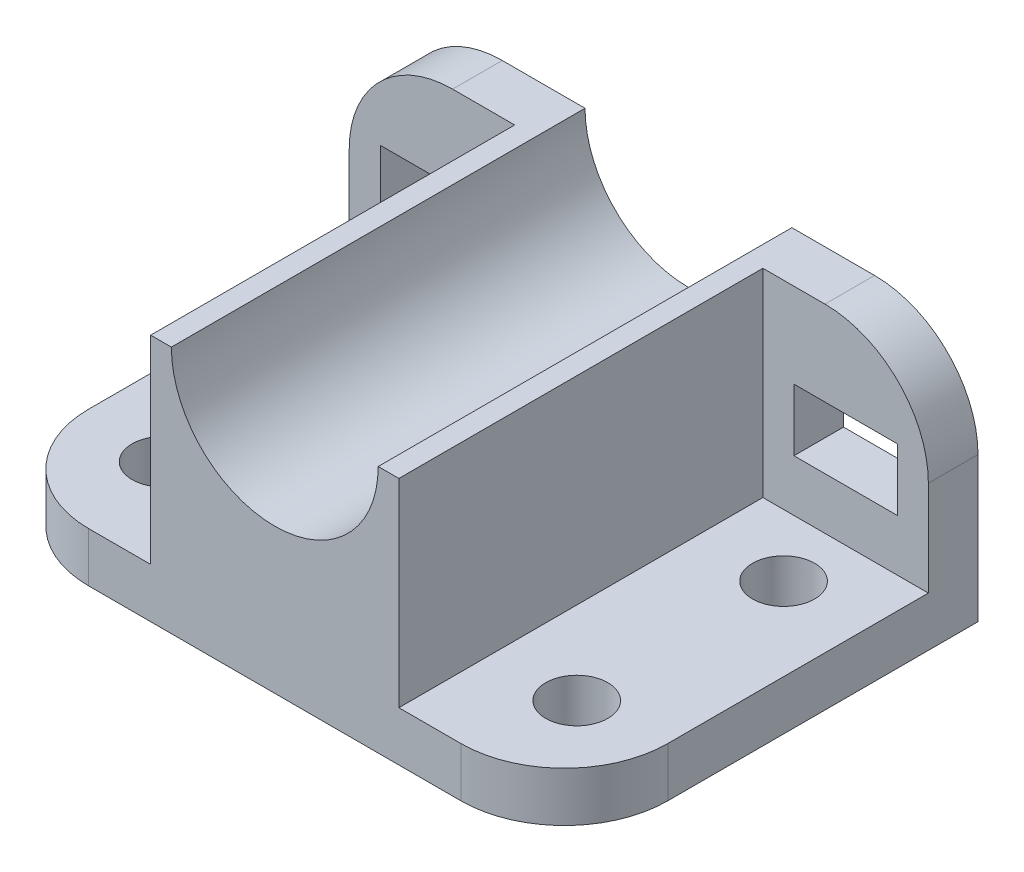
ISO-10303-21;
HEADER;
FILE_DESCRIPTION(('STEP AP214'),'2;1');
FILE_NAME('part.step','',(''),(''),'','','');
FILE_SCHEMA(('AUTOMOTIVE_DESIGN { 1 0 10303 214 1 1 1 1 }'));
ENDSEC;
DATA;
#1=APPLICATION_CONTEXT('core data for automotive mechanical design processes');
#2=APPLICATION_PROTOCOL_DEFINITION('international standard','automotive_design',2000,#1);
#3=PRODUCT_CONTEXT('',#1,'mechanical');
#4=PRODUCT('Part','Part','',(#3));
#5=PRODUCT_RELATED_PRODUCT_CATEGORY('part','',(#4));
#6=PRODUCT_DEFINITION_FORMATION('','',#4);
#7=PRODUCT_DEFINITION_CONTEXT('part definition',#1,'design');
#8=PRODUCT_DEFINITION('design','',#6,#7);
#9=PRODUCT_DEFINITION_SHAPE('','',#8);
#10=(LENGTH_UNIT() NAMED_UNIT(*) SI_UNIT(.MILLI.,.METRE.));
#11=(NAMED_UNIT(*) PLANE_ANGLE_UNIT() SI_UNIT($,.RADIAN.));
#12=(NAMED_UNIT(*) SI_UNIT($,.STERADIAN.) SOLID_ANGLE_UNIT());
#13=UNCERTAINTY_MEASURE_WITH_UNIT(LENGTH_MEASURE(1.E-05),#10,'distance_accuracy_value','');
#14=(GEOMETRIC_REPRESENTATION_CONTEXT(3) GLOBAL_UNCERTAINTY_ASSIGNED_CONTEXT((#13)) GLOBAL_UNIT_ASSIGNED_CONTEXT((#10,
#11,#12)) REPRESENTATION_CONTEXT('',''));
#15=CARTESIAN_POINT('',(0.,0.,0.));
#16=DIRECTION('',(0.,0.,1.));
#17=DIRECTION('',(1.,0.,0.));
#18=AXIS2_PLACEMENT_3D('',#15,#16,#17);
#19=CARTESIAN_POINT('',(-50.,-88.,27.));
#20=DIRECTION('',(0.,1.,0.));
#21=DIRECTION('',(0.,0.,1.));
#22=AXIS2_PLACEMENT_3D('',#19,#20,#21);
#23=CYLINDRICAL_SURFACE('',#22,7.5);
#24=CARTESIAN_POINT('',(-50.,0.,27.));
#25=DIRECTION('',(0.,-1.,0.));
#26=DIRECTION('',(0.,0.,-1.));
#27=AXIS2_PLACEMENT_3D('',#24,#25,#26);
#28=CIRCLE('',#27,7.5);
#29=CARTESIAN_POINT('',(-50.,0.,19.5));
#30=VERTEX_POINT('',#29);
#31=EDGE_CURVE('E391',#30,#30,#28,.T.);
#32=ORIENTED_EDGE('',*,*,#31,.T.);
#33=EDGE_LOOP('',(#32));
#34=FACE_BOUND('',#33,.T.);
#35=CARTESIAN_POINT('',(-50.,12.,27.));
#36=DIRECTION('',(0.,1.,0.));
#37=DIRECTION('',(0.,0.,1.));
#38=AXIS2_PLACEMENT_3D('',#35,#36,#37);
#39=CIRCLE('',#38,7.5);
#40=CARTESIAN_POINT('',(-50.,12.,34.5));
#41=VERTEX_POINT('',#40);
#42=EDGE_CURVE('E394',#41,#41,#39,.T.);
#43=ORIENTED_EDGE('',*,*,#42,.T.);
#44=EDGE_LOOP('',(#43));
#45=FACE_BOUND('',#44,.T.);
#46=ADVANCED_FACE('F32',(#34,#45),#23,.F.);
#47=CARTESIAN_POINT('',(-50.,-88.,-23.));
#48=DIRECTION('',(0.,1.,0.));
#49=DIRECTION('',(0.,0.,1.));
#50=AXIS2_PLACEMENT_3D('',#47,#48,#49);
#51=CYLINDRICAL_SURFACE('',#50,7.5);
#52=CARTESIAN_POINT('',(-50.,0.,-23.));
#53=DIRECTION('',(0.,-1.,0.));
#54=DIRECTION('',(0.,0.,-1.));
#55=AXIS2_PLACEMENT_3D('',#52,#53,#54);
#56=CIRCLE('',#55,7.5);
#57=CARTESIAN_POINT('',(-50.,0.,-30.5));
#58=VERTEX_POINT('',#57);
#59=EDGE_CURVE('E385',#58,#58,#56,.T.);
#60=ORIENTED_EDGE('',*,*,#59,.T.);
#61=EDGE_LOOP('',(#60));
#62=FACE_BOUND('',#61,.T.);
#63=CARTESIAN_POINT('',(-50.,12.,-23.));
#64=DIRECTION('',(0.,1.,0.));
#65=DIRECTION('',(0.,0.,1.));
#66=AXIS2_PLACEMENT_3D('',#63,#64,#65);
#67=CIRCLE('',#66,7.5);
#68=CARTESIAN_POINT('',(-50.,12.,-15.5));
#69=VERTEX_POINT('',#68);
#70=EDGE_CURVE('E388',#69,#69,#67,.T.);
#71=ORIENTED_EDGE('',*,*,#70,.T.);
#72=EDGE_LOOP('',(#71));
#73=FACE_BOUND('',#72,.T.);
#74=ADVANCED_FACE('F421',(#62,#73),#51,.F.);
#75=CARTESIAN_POINT('',(50.,-88.,27.));
#76=DIRECTION('',(0.,1.,0.));
#77=DIRECTION('',(0.,0.,1.));
#78=AXIS2_PLACEMENT_3D('',#75,#76,#77);
#79=CYLINDRICAL_SURFACE('',#78,7.5);
#80=CARTESIAN_POINT('',(50.,0.,27.));
#81=DIRECTION('',(0.,-1.,0.));
#82=DIRECTION('',(0.,0.,-1.));
#83=AXIS2_PLACEMENT_3D('',#80,#81,#82);
#84=CIRCLE('',#83,7.5);
#85=CARTESIAN_POINT('',(50.,0.,19.5));
#86=VERTEX_POINT('',#85);
#87=EDGE_CURVE('E377',#86,#86,#84,.T.);
#88=ORIENTED_EDGE('',*,*,#87,.T.);
#89=EDGE_LOOP('',(#88));
#90=FACE_BOUND('',#89,.T.);
#91=CARTESIAN_POINT('',(50.,12.,27.));
#92=DIRECTION('',(0.,1.,0.));
#93=DIRECTION('',(0.,0.,1.));
#94=AXIS2_PLACEMENT_3D('',#91,#92,#93);
#95=CIRCLE('',#94,7.5);
#96=CARTESIAN_POINT('',(50.,12.,34.5));
#97=VERTEX_POINT('',#96);
#98=EDGE_CURVE('E382',#97,#97,#95,.T.);
#99=ORIENTED_EDGE('',*,*,#98,.T.);
#100=EDGE_LOOP('',(#99));
#101=FACE_BOUND('',#100,.T.);
#102=ADVANCED_FACE('F426',(#90,#101),#79,.F.);
#103=CARTESIAN_POINT('',(44.9999999999998,60.,-38.));
#104=DIRECTION('',(0.,1.,0.));
#105=DIRECTION('',(0.,0.,1.));
#106=AXIS2_PLACEMENT_3D('',#103,#104,#105);
#107=PLANE('',#106);
#108=DIRECTION('',(0.,0.,-1.));
#109=VECTOR('',#108,1.);
#110=CARTESIAN_POINT('',(-25.,60.,50.));
#111=LINE('',#110,#109);
#112=CARTESIAN_POINT('',(-25.,60.,50.));
#113=VERTEX_POINT('',#112);
#114=CARTESIAN_POINT('',(-25.,60.,-50.));
#115=VERTEX_POINT('',#114);
#116=EDGE_CURVE('E274',#113,#115,#111,.T.);
#117=ORIENTED_EDGE('',*,*,#116,.T.);
#118=DIRECTION('',(1.,0.,0.));
#119=VECTOR('',#118,1.);
#120=CARTESIAN_POINT('',(44.9999999999998,60.,-50.));
#121=LINE('',#120,#119);
#122=CARTESIAN_POINT('',(-44.9999999999998,60.,-50.));
#123=VERTEX_POINT('',#122);
#124=EDGE_CURVE('E311',#123,#115,#121,.T.);
#125=ORIENTED_EDGE('',*,*,#124,.F.);
#126=DIRECTION('',(0.,0.,-1.));
#127=VECTOR('',#126,1.);
#128=CARTESIAN_POINT('',(-44.9999999999998,60.,-38.));
#129=LINE('',#128,#127);
#130=CARTESIAN_POINT('',(-44.9999999999998,60.,-38.));
#131=VERTEX_POINT('',#130);
#132=EDGE_CURVE('E324',#131,#123,#129,.T.);
#133=ORIENTED_EDGE('',*,*,#132,.F.);
#134=DIRECTION('',(1.,0.,0.));
#135=VECTOR('',#134,1.);
#136=CARTESIAN_POINT('',(44.9999999999998,60.,-38.));
#137=LINE('',#136,#135);
#138=CARTESIAN_POINT('',(-30.,60.,-38.));
#139=VERTEX_POINT('',#138);
#140=EDGE_CURVE('E298',#131,#139,#137,.T.);
#141=ORIENTED_EDGE('',*,*,#140,.T.);
#142=DIRECTION('',(0.,0.,-1.));
#143=VECTOR('',#142,1.);
#144=CARTESIAN_POINT('',(-30.,60.,50.));
#145=LINE('',#144,#143);
#146=CARTESIAN_POINT('',(-30.,60.,50.));
#147=VERTEX_POINT('',#146);
#148=EDGE_CURVE('E277',#147,#139,#145,.T.);
#149=ORIENTED_EDGE('',*,*,#148,.F.);
#150=DIRECTION('',(1.,0.,0.));
#151=VECTOR('',#150,1.);
#152=CARTESIAN_POINT('',(-30.,60.,50.));
#153=LINE('',#152,#151);
#154=EDGE_CURVE('E270',#147,#113,#153,.T.);
#155=ORIENTED_EDGE('',*,*,#154,.T.);
#156=EDGE_LOOP('',(#117,#125,#133,#141,#149,#155));
#157=FACE_BOUND('',#156,.T.);
#158=ADVANCED_FACE('F435',(#157),#107,.T.);
#159=CARTESIAN_POINT('',(-45.,12.,25.));
#160=DIRECTION('',(0.,-1.,0.));
#161=DIRECTION('',(0.,0.,-1.));
#162=AXIS2_PLACEMENT_3D('',#159,#160,#161);
#163=PLANE('',#162);
#164=ORIENTED_EDGE('',*,*,#42,.F.);
#165=EDGE_LOOP('',(#164));
#166=FACE_BOUND('',#165,.T.);
#167=ORIENTED_EDGE('',*,*,#70,.F.);
#168=EDGE_LOOP('',(#167));
#169=FACE_BOUND('',#168,.T.);
#170=DIRECTION('',(1.,0.,0.));
#171=VECTOR('',#170,1.);
#172=CARTESIAN_POINT('',(-44.9999999999998,12.,50.));
#173=LINE('',#172,#171);
#174=CARTESIAN_POINT('',(-44.9999999999998,12.,50.));
#175=VERTEX_POINT('',#174);
#176=CARTESIAN_POINT('',(-30.,12.,50.));
#177=VERTEX_POINT('',#176);
#178=EDGE_CURVE('E334',#175,#177,#173,.T.);
#179=ORIENTED_EDGE('',*,*,#178,.T.);
#180=DIRECTION('',(0.,0.,-1.));
#181=VECTOR('',#180,1.);
#182=CARTESIAN_POINT('',(-30.,12.,50.));
#183=LINE('',#182,#181);
#184=CARTESIAN_POINT('',(-30.,12.,-38.));
#185=VERTEX_POINT('',#184);
#186=EDGE_CURVE('E279',#177,#185,#183,.T.);
#187=ORIENTED_EDGE('',*,*,#186,.T.);
#188=DIRECTION('',(-1.,0.,0.));
#189=VECTOR('',#188,1.);
#190=CARTESIAN_POINT('',(70.,12.,-38.));
#191=LINE('',#190,#189);
#192=CARTESIAN_POINT('',(-70.,12.,-38.));
#193=VERTEX_POINT('',#192);
#194=EDGE_CURVE('E291',#185,#193,#191,.T.);
#195=ORIENTED_EDGE('',*,*,#194,.T.);
#196=DIRECTION('',(0.,0.,1.));
#197=VECTOR('',#196,1.);
#198=CARTESIAN_POINT('',(-70.,12.,-50.));
#199=LINE('',#198,#197);
#200=CARTESIAN_POINT('',(-70.,12.,24.9999999999998));
#201=VERTEX_POINT('',#200);
#202=EDGE_CURVE('E328',#193,#201,#199,.T.);
#203=ORIENTED_EDGE('',*,*,#202,.T.);
#204=CARTESIAN_POINT('',(-45.,12.,25.));
#205=DIRECTION('',(0.,1.,0.));
#206=DIRECTION('',(0.,0.,-1.));
#207=AXIS2_PLACEMENT_3D('',#204,#205,#206);
#208=CIRCLE('',#207,25.);
#209=EDGE_CURVE('E330',#201,#175,#208,.T.);
#210=ORIENTED_EDGE('',*,*,#209,.T.);
#211=EDGE_LOOP('',(#179,#187,#195,#203,#210));
#212=FACE_BOUND('',#211,.T.);
#213=ADVANCED_FACE('F432',(#166,#169,#212),#163,.F.);
#214=CARTESIAN_POINT('',(-45.,35.,-38.));
#215=DIRECTION('',(0.,0.,-1.));
#216=DIRECTION('',(-1.,0.,0.));
#217=AXIS2_PLACEMENT_3D('',#214,#215,#216);
#218=PLANE('',#217);
#219=DIRECTION('',(0.,-1.,0.));
#220=VECTOR('',#219,1.);
#221=CARTESIAN_POINT('',(-62.5,39.5,-38.));
#222=LINE('',#221,#220);
#223=CARTESIAN_POINT('',(-62.5,39.5,-38.));
#224=VERTEX_POINT('',#223);
#225=CARTESIAN_POINT('',(-62.5,24.5,-38.));
#226=VERTEX_POINT('',#225);
#227=EDGE_CURVE('E204',#224,#226,#222,.T.);
#228=ORIENTED_EDGE('',*,*,#227,.F.);
#229=DIRECTION('',(-1.,0.,0.));
#230=VECTOR('',#229,1.);
#231=CARTESIAN_POINT('',(-37.5,39.5,-38.));
#232=LINE('',#231,#230);
#233=CARTESIAN_POINT('',(-37.5,39.5,-38.));
#234=VERTEX_POINT('',#233);
#235=EDGE_CURVE('E46',#234,#224,#232,.T.);
#236=ORIENTED_EDGE('',*,*,#235,.F.);
#237=DIRECTION('',(0.,1.,0.));
#238=VECTOR('',#237,1.);
#239=CARTESIAN_POINT('',(-37.5,39.5,-38.));
#240=LINE('',#239,#238);
#241=CARTESIAN_POINT('',(-37.5,24.5,-38.));
#242=VERTEX_POINT('',#241);
#243=EDGE_CURVE('E211',#242,#234,#240,.T.);
#244=ORIENTED_EDGE('',*,*,#243,.F.);
#245=DIRECTION('',(1.,0.,0.));
#246=VECTOR('',#245,1.);
#247=CARTESIAN_POINT('',(-37.5,24.5,-38.));
#248=LINE('',#247,#246);
#249=EDGE_CURVE('E195',#226,#242,#248,.T.);
#250=ORIENTED_EDGE('',*,*,#249,.F.);
#251=EDGE_LOOP('',(#228,#236,#244,#250));
#252=FACE_BOUND('',#251,.T.);
#253=ORIENTED_EDGE('',*,*,#194,.F.);
#254=DIRECTION('',(0.,1.,0.));
#255=VECTOR('',#254,1.);
#256=CARTESIAN_POINT('',(-30.,35.,-38.));
#257=LINE('',#256,#255);
#258=EDGE_CURVE('E374',#185,#139,#257,.T.);
#259=ORIENTED_EDGE('',*,*,#258,.T.);
#260=ORIENTED_EDGE('',*,*,#140,.F.);
#261=CARTESIAN_POINT('',(-45.,35.,-38.));
#262=DIRECTION('',(0.,0.,-1.));
#263=DIRECTION('',(-1.,0.,0.));
#264=AXIS2_PLACEMENT_3D('',#261,#262,#263);
#265=CIRCLE('',#264,25.);
#266=CARTESIAN_POINT('',(-70.,34.9999999999998,-38.));
#267=VERTEX_POINT('',#266);
#268=EDGE_CURVE('E294',#267,#131,#265,.T.);
#269=ORIENTED_EDGE('',*,*,#268,.F.);
#270=DIRECTION('',(0.,1.,0.));
#271=VECTOR('',#270,1.);
#272=CARTESIAN_POINT('',(-70.,34.9999999999998,-38.));
#273=LINE('',#272,#271);
#274=EDGE_CURVE('E290',#193,#267,#273,.T.);
#275=ORIENTED_EDGE('',*,*,#274,.F.);
#276=EDGE_LOOP('',(#253,#259,#260,#269,#275));
#277=FACE_BOUND('',#276,.T.);
#278=ADVANCED_FACE('F208',(#252,#277),#218,.F.);
#279=CARTESIAN_POINT('',(-70.,12.,-50.));
#280=DIRECTION('',(1.,0.,0.));
#281=DIRECTION('',(0.,0.,-1.));
#282=AXIS2_PLACEMENT_3D('',#279,#280,#281);
#283=PLANE('',#282);
#284=DIRECTION('',(0.,0.,1.));
#285=VECTOR('',#284,1.);
#286=CARTESIAN_POINT('',(-70.,0.,-50.));
#287=LINE('',#286,#285);
#288=CARTESIAN_POINT('',(-70.,0.,-50.));
#289=VERTEX_POINT('',#288);
#290=CARTESIAN_POINT('',(-70.,0.,24.9999999999998));
#291=VERTEX_POINT('',#290);
#292=EDGE_CURVE('E320',#289,#291,#287,.T.);
#293=ORIENTED_EDGE('',*,*,#292,.T.);
#294=DIRECTION('',(0.,-1.,0.));
#295=VECTOR('',#294,1.);
#296=CARTESIAN_POINT('',(-70.,12.,24.9999999999998));
#297=LINE('',#296,#295);
#298=EDGE_CURVE('E368',#201,#291,#297,.T.);
#299=ORIENTED_EDGE('',*,*,#298,.F.);
#300=ORIENTED_EDGE('',*,*,#202,.F.);
#301=ORIENTED_EDGE('',*,*,#274,.T.);
#302=DIRECTION('',(0.,0.,-1.));
#303=VECTOR('',#302,1.);
#304=CARTESIAN_POINT('',(-70.,34.9999999999998,-38.));
#305=LINE('',#304,#303);
#306=CARTESIAN_POINT('',(-70.,34.9999999999998,-50.));
#307=VERTEX_POINT('',#306);
#308=EDGE_CURVE('E307',#267,#307,#305,.T.);
#309=ORIENTED_EDGE('',*,*,#308,.T.);
#310=DIRECTION('',(0.,-1.,0.));
#311=VECTOR('',#310,1.);
#312=CARTESIAN_POINT('',(-70.,12.,-50.));
#313=LINE('',#312,#311);
#314=EDGE_CURVE('E342',#307,#289,#313,.T.);
#315=ORIENTED_EDGE('',*,*,#314,.T.);
#316=EDGE_LOOP('',(#293,#299,#300,#301,#309,#315));
#317=FACE_BOUND('',#316,.T.);
#318=ADVANCED_FACE('F462',(#317),#283,.F.);
#319=CARTESIAN_POINT('',(-45.,12.,25.));
#320=DIRECTION('',(0.,-1.,0.));
#321=DIRECTION('',(0.,0.,-1.));
#322=AXIS2_PLACEMENT_3D('',#319,#320,#321);
#323=CYLINDRICAL_SURFACE('',#322,25.);
#324=CARTESIAN_POINT('',(-45.,0.,25.));
#325=DIRECTION('',(0.,1.,0.));
#326=DIRECTION('',(0.,0.,-1.));
#327=AXIS2_PLACEMENT_3D('',#324,#325,#326);
#328=CIRCLE('',#327,25.);
#329=CARTESIAN_POINT('',(-44.9999999999998,0.,50.));
#330=VERTEX_POINT('',#329);
#331=EDGE_CURVE('E345',#291,#330,#328,.T.);
#332=ORIENTED_EDGE('',*,*,#331,.T.);
#333=DIRECTION('',(0.,-1.,0.));
#334=VECTOR('',#333,1.);
#335=CARTESIAN_POINT('',(-44.9999999999998,12.,50.));
#336=LINE('',#335,#334);
#337=EDGE_CURVE('E365',#175,#330,#336,.T.);
#338=ORIENTED_EDGE('',*,*,#337,.F.);
#339=ORIENTED_EDGE('',*,*,#209,.F.);
#340=ORIENTED_EDGE('',*,*,#298,.T.);
#341=EDGE_LOOP('',(#332,#338,#339,#340));
#342=FACE_BOUND('',#341,.T.);
#343=ADVANCED_FACE('F465',(#342),#323,.T.);
#344=CARTESIAN_POINT('',(-44.9999999999998,12.,50.));
#345=DIRECTION('',(0.,0.,-1.));
#346=DIRECTION('',(-1.,0.,0.));
#347=AXIS2_PLACEMENT_3D('',#344,#345,#346);
#348=PLANE('',#347);
#349=DIRECTION('',(1.,0.,0.));
#350=VECTOR('',#349,1.);
#351=CARTESIAN_POINT('',(-44.9999999999998,0.,50.));
#352=LINE('',#351,#350);
#353=CARTESIAN_POINT('',(44.9999999999998,0.,50.));
#354=VERTEX_POINT('',#353);
#355=EDGE_CURVE('E347',#330,#354,#352,.T.);
#356=ORIENTED_EDGE('',*,*,#355,.T.);
#357=DIRECTION('',(0.,-1.,0.));
#358=VECTOR('',#357,1.);
#359=CARTESIAN_POINT('',(44.9999999999998,12.,50.));
#360=LINE('',#359,#358);
#361=CARTESIAN_POINT('',(44.9999999999998,12.,50.));
#362=VERTEX_POINT('',#361);
#363=EDGE_CURVE('E362',#362,#354,#360,.T.);
#364=ORIENTED_EDGE('',*,*,#363,.F.);
#365=CARTESIAN_POINT('',(30.,12.,50.));
#366=VERTEX_POINT('',#365);
#367=EDGE_CURVE('E333',#366,#362,#173,.T.);
#368=ORIENTED_EDGE('',*,*,#367,.F.);
#369=DIRECTION('',(0.,-1.,0.));
#370=VECTOR('',#369,1.);
#371=CARTESIAN_POINT('',(30.,60.,50.));
#372=LINE('',#371,#370);
#373=CARTESIAN_POINT('',(30.,60.,50.));
#374=VERTEX_POINT('',#373);
#375=EDGE_CURVE('E265',#374,#366,#372,.T.);
#376=ORIENTED_EDGE('',*,*,#375,.F.);
#377=DIRECTION('',(1.,0.,0.));
#378=VECTOR('',#377,1.);
#379=CARTESIAN_POINT('',(25.,60.,50.));
#380=LINE('',#379,#378);
#381=CARTESIAN_POINT('',(25.,60.,50.));
#382=VERTEX_POINT('',#381);
#383=EDGE_CURVE('E262',#382,#374,#380,.T.);
#384=ORIENTED_EDGE('',*,*,#383,.F.);
#385=CARTESIAN_POINT('',(0.,60.,50.));
#386=DIRECTION('',(0.,0.,1.));
#387=DIRECTION('',(-1.,0.,0.));
#388=AXIS2_PLACEMENT_3D('',#385,#386,#387);
#389=CIRCLE('',#388,25.);
#390=EDGE_CURVE('E259',#113,#382,#389,.T.);
#391=ORIENTED_EDGE('',*,*,#390,.F.);
#392=ORIENTED_EDGE('',*,*,#154,.F.);
#393=DIRECTION('',(0.,1.,0.));
#394=VECTOR('',#393,1.);
#395=CARTESIAN_POINT('',(-30.,12.,50.));
#396=LINE('',#395,#394);
#397=EDGE_CURVE('E267',#177,#147,#396,.T.);
#398=ORIENTED_EDGE('',*,*,#397,.F.);
#399=ORIENTED_EDGE('',*,*,#178,.F.);
#400=ORIENTED_EDGE('',*,*,#337,.T.);
#401=EDGE_LOOP('',(#356,#364,#368,#376,#384,#391,#392,#398,#399,#400));
#402=FACE_BOUND('',#401,.T.);
#403=ADVANCED_FACE('F446',(#402),#348,.F.);
#404=CARTESIAN_POINT('',(45.,12.,25.));
#405=DIRECTION('',(0.,-1.,0.));
#406=DIRECTION('',(0.,0.,-1.));
#407=AXIS2_PLACEMENT_3D('',#404,#405,#406);
#408=CYLINDRICAL_SURFACE('',#407,25.);
#409=CARTESIAN_POINT('',(45.,0.,25.));
#410=DIRECTION('',(0.,1.,0.));
#411=DIRECTION('',(0.,0.,1.));
#412=AXIS2_PLACEMENT_3D('',#409,#410,#411);
#413=CIRCLE('',#412,25.);
#414=CARTESIAN_POINT('',(70.,0.,24.9999999999998));
#415=VERTEX_POINT('',#414);
#416=EDGE_CURVE('E349',#354,#415,#413,.T.);
#417=ORIENTED_EDGE('',*,*,#416,.T.);
#418=DIRECTION('',(0.,-1.,0.));
#419=VECTOR('',#418,1.);
#420=CARTESIAN_POINT('',(70.,12.,24.9999999999998));
#421=LINE('',#420,#419);
#422=CARTESIAN_POINT('',(70.,12.,24.9999999999998));
#423=VERTEX_POINT('',#422);
#424=EDGE_CURVE('E359',#423,#415,#421,.T.);
#425=ORIENTED_EDGE('',*,*,#424,.F.);
#426=CARTESIAN_POINT('',(45.,12.,25.));
#427=DIRECTION('',(0.,1.,0.));
#428=DIRECTION('',(0.,0.,1.));
#429=AXIS2_PLACEMENT_3D('',#426,#427,#428);
#430=CIRCLE('',#429,25.);
#431=EDGE_CURVE('E337',#362,#423,#430,.T.);
#432=ORIENTED_EDGE('',*,*,#431,.F.);
#433=ORIENTED_EDGE('',*,*,#363,.T.);
#434=EDGE_LOOP('',(#417,#425,#432,#433));
#435=FACE_BOUND('',#434,.T.);
#436=ADVANCED_FACE('F476',(#435),#408,.T.);
#437=CARTESIAN_POINT('',(70.,12.,-50.));
#438=DIRECTION('',(-1.,0.,0.));
#439=DIRECTION('',(0.,0.,1.));
#440=AXIS2_PLACEMENT_3D('',#437,#438,#439);
#441=PLANE('',#440);
#442=DIRECTION('',(0.,0.,-1.));
#443=VECTOR('',#442,1.);
#444=CARTESIAN_POINT('',(70.,0.,-50.));
#445=LINE('',#444,#443);
#446=CARTESIAN_POINT('',(70.,0.,-50.));
#447=VERTEX_POINT('',#446);
#448=EDGE_CURVE('E351',#415,#447,#445,.T.);
#449=ORIENTED_EDGE('',*,*,#448,.T.);
#450=DIRECTION('',(0.,-1.,0.));
#451=VECTOR('',#450,1.);
#452=CARTESIAN_POINT('',(70.,12.,-50.));
#453=LINE('',#452,#451);
#454=CARTESIAN_POINT('',(70.,34.9999999999998,-50.));
#455=VERTEX_POINT('',#454);
#456=EDGE_CURVE('E356',#455,#447,#453,.T.);
#457=ORIENTED_EDGE('',*,*,#456,.F.);
#458=DIRECTION('',(0.,0.,-1.));
#459=VECTOR('',#458,1.);
#460=CARTESIAN_POINT('',(70.,34.9999999999998,-38.));
#461=LINE('',#460,#459);
#462=CARTESIAN_POINT('',(70.,34.9999999999998,-38.));
#463=VERTEX_POINT('',#462);
#464=EDGE_CURVE('E317',#463,#455,#461,.T.);
#465=ORIENTED_EDGE('',*,*,#464,.F.);
#466=DIRECTION('',(0.,-1.,0.));
#467=VECTOR('',#466,1.);
#468=CARTESIAN_POINT('',(70.,12.,-38.));
#469=LINE('',#468,#467);
#470=CARTESIAN_POINT('',(70.,12.,-38.));
#471=VERTEX_POINT('',#470);
#472=EDGE_CURVE('E304',#463,#471,#469,.T.);
#473=ORIENTED_EDGE('',*,*,#472,.T.);
#474=DIRECTION('',(0.,0.,-1.));
#475=VECTOR('',#474,1.);
#476=CARTESIAN_POINT('',(70.,12.,-50.));
#477=LINE('',#476,#475);
#478=EDGE_CURVE('E339',#423,#471,#477,.T.);
#479=ORIENTED_EDGE('',*,*,#478,.F.);
#480=ORIENTED_EDGE('',*,*,#424,.T.);
#481=EDGE_LOOP('',(#449,#457,#465,#473,#479,#480));
#482=FACE_BOUND('',#481,.T.);
#483=ADVANCED_FACE('F493',(#482),#441,.F.);
#484=CARTESIAN_POINT('',(-70.,12.,-50.));
#485=DIRECTION('',(0.,0.,1.));
#486=DIRECTION('',(1.,0.,0.));
#487=AXIS2_PLACEMENT_3D('',#484,#485,#486);
#488=PLANE('',#487);
#489=DIRECTION('',(0.,1.,0.));
#490=VECTOR('',#489,1.);
#491=CARTESIAN_POINT('',(-37.5,12.,-50.));
#492=LINE('',#491,#490);
#493=CARTESIAN_POINT('',(-37.5,24.5,-50.));
#494=VERTEX_POINT('',#493);
#495=CARTESIAN_POINT('',(-37.5,39.5,-50.));
#496=VERTEX_POINT('',#495);
#497=EDGE_CURVE('E39',#494,#496,#492,.T.);
#498=ORIENTED_EDGE('',*,*,#497,.T.);
#499=DIRECTION('',(-1.,0.,0.));
#500=VECTOR('',#499,1.);
#501=CARTESIAN_POINT('',(-70.,39.5,-50.));
#502=LINE('',#501,#500);
#503=CARTESIAN_POINT('',(-62.5,39.5,-50.));
#504=VERTEX_POINT('',#503);
#505=EDGE_CURVE('E11',#496,#504,#502,.T.);
#506=ORIENTED_EDGE('',*,*,#505,.T.);
#507=DIRECTION('',(0.,-1.,0.));
#508=VECTOR('',#507,1.);
#509=CARTESIAN_POINT('',(-62.5,12.,-50.));
#510=LINE('',#509,#508);
#511=CARTESIAN_POINT('',(-62.5,24.5,-50.));
#512=VERTEX_POINT('',#511);
#513=EDGE_CURVE('E397',#504,#512,#510,.T.);
#514=ORIENTED_EDGE('',*,*,#513,.T.);
#515=DIRECTION('',(1.,0.,0.));
#516=VECTOR('',#515,1.);
#517=CARTESIAN_POINT('',(-70.,24.5,-50.));
#518=LINE('',#517,#516);
#519=EDGE_CURVE('E198',#512,#494,#518,.T.);
#520=ORIENTED_EDGE('',*,*,#519,.T.);
#521=EDGE_LOOP('',(#498,#506,#514,#520));
#522=FACE_BOUND('',#521,.T.);
#523=DIRECTION('',(-1.,0.,0.));
#524=VECTOR('',#523,1.);
#525=CARTESIAN_POINT('',(-70.,39.5,-50.));
#526=LINE('',#525,#524);
#527=CARTESIAN_POINT('',(62.5,39.5,-50.));
#528=VERTEX_POINT('',#527);
#529=CARTESIAN_POINT('',(37.5,39.5,-50.));
#530=VERTEX_POINT('',#529);
#531=EDGE_CURVE('E246',#528,#530,#526,.T.);
#532=ORIENTED_EDGE('',*,*,#531,.T.);
#533=DIRECTION('',(0.,-1.,0.));
#534=VECTOR('',#533,1.);
#535=CARTESIAN_POINT('',(37.5,12.,-50.));
#536=LINE('',#535,#534);
#537=CARTESIAN_POINT('',(37.5,24.5,-50.));
#538=VERTEX_POINT('',#537);
#539=EDGE_CURVE('E249',#530,#538,#536,.T.);
#540=ORIENTED_EDGE('',*,*,#539,.T.);
#541=DIRECTION('',(1.,0.,0.));
#542=VECTOR('',#541,1.);
#543=CARTESIAN_POINT('',(-70.,24.5,-50.));
#544=LINE('',#543,#542);
#545=CARTESIAN_POINT('',(62.5,24.5,-50.));
#546=VERTEX_POINT('',#545);
#547=EDGE_CURVE('E234',#538,#546,#544,.T.);
#548=ORIENTED_EDGE('',*,*,#547,.T.);
#549=DIRECTION('',(0.,1.,0.));
#550=VECTOR('',#549,1.);
#551=CARTESIAN_POINT('',(62.5,12.,-50.));
#552=LINE('',#551,#550);
#553=EDGE_CURVE('E243',#546,#528,#552,.T.);
#554=ORIENTED_EDGE('',*,*,#553,.T.);
#555=EDGE_LOOP('',(#532,#540,#548,#554));
#556=FACE_BOUND('',#555,.T.);
#557=ORIENTED_EDGE('',*,*,#124,.T.);
#558=CARTESIAN_POINT('',(0.,60.,-50.));
#559=DIRECTION('',(0.,0.,1.));
#560=DIRECTION('',(1.,0.,0.));
#561=AXIS2_PLACEMENT_3D('',#558,#559,#560);
#562=CIRCLE('',#561,25.);
#563=CARTESIAN_POINT('',(25.,60.,-50.));
#564=VERTEX_POINT('',#563);
#565=EDGE_CURVE('E256',#115,#564,#562,.T.);
#566=ORIENTED_EDGE('',*,*,#565,.T.);
#567=CARTESIAN_POINT('',(44.9999999999998,60.,-50.));
#568=VERTEX_POINT('',#567);
#569=EDGE_CURVE('E310',#564,#568,#121,.T.);
#570=ORIENTED_EDGE('',*,*,#569,.T.);
#571=CARTESIAN_POINT('',(45.,35.,-50.));
#572=DIRECTION('',(0.,0.,-1.));
#573=DIRECTION('',(1.,0.,0.));
#574=AXIS2_PLACEMENT_3D('',#571,#572,#573);
#575=CIRCLE('',#574,25.);
#576=EDGE_CURVE('E314',#568,#455,#575,.T.);
#577=ORIENTED_EDGE('',*,*,#576,.T.);
#578=ORIENTED_EDGE('',*,*,#456,.T.);
#579=DIRECTION('',(-1.,0.,0.));
#580=VECTOR('',#579,1.);
#581=CARTESIAN_POINT('',(-70.,0.,-50.));
#582=LINE('',#581,#580);
#583=EDGE_CURVE('E331',#447,#289,#582,.T.);
#584=ORIENTED_EDGE('',*,*,#583,.T.);
#585=ORIENTED_EDGE('',*,*,#314,.F.);
#586=CARTESIAN_POINT('',(-45.,35.,-50.));
#587=DIRECTION('',(0.,0.,-1.));
#588=DIRECTION('',(-1.,0.,0.));
#589=AXIS2_PLACEMENT_3D('',#586,#587,#588);
#590=CIRCLE('',#589,25.);
#591=EDGE_CURVE('E276',#307,#123,#590,.T.);
#592=ORIENTED_EDGE('',*,*,#591,.T.);
#593=EDGE_LOOP('',(#557,#566,#570,#577,#578,#584,#585,#592));
#594=FACE_BOUND('',#593,.T.);
#595=ADVANCED_FACE('F401',(#522,#556,#594),#488,.F.);
#596=ORIENTED_EDGE('',*,*,#98,.F.);
#597=EDGE_LOOP('',(#596));
#598=FACE_BOUND('',#597,.T.);
#599=CARTESIAN_POINT('',(50.,12.,-23.));
#600=DIRECTION('',(0.,1.,0.));
#601=DIRECTION('',(0.,0.,1.));
#602=AXIS2_PLACEMENT_3D('',#599,#600,#601);
#603=CIRCLE('',#602,7.5);
#604=CARTESIAN_POINT('',(50.,12.,-15.5));
#605=VERTEX_POINT('',#604);
#606=EDGE_CURVE('E252',#605,#605,#603,.T.);
#607=ORIENTED_EDGE('',*,*,#606,.F.);
#608=EDGE_LOOP('',(#607));
#609=FACE_BOUND('',#608,.T.);
#610=CARTESIAN_POINT('',(30.,12.,-38.));
#611=VERTEX_POINT('',#610);
#612=EDGE_CURVE('E287',#471,#611,#191,.T.);
#613=ORIENTED_EDGE('',*,*,#612,.T.);
#614=DIRECTION('',(0.,0.,-1.));
#615=VECTOR('',#614,1.);
#616=CARTESIAN_POINT('',(30.,12.,50.));
#617=LINE('',#616,#615);
#618=EDGE_CURVE('E282',#366,#611,#617,.T.);
#619=ORIENTED_EDGE('',*,*,#618,.F.);
#620=ORIENTED_EDGE('',*,*,#367,.T.);
#621=ORIENTED_EDGE('',*,*,#431,.T.);
#622=ORIENTED_EDGE('',*,*,#478,.T.);
#623=EDGE_LOOP('',(#613,#619,#620,#621,#622));
#624=FACE_BOUND('',#623,.T.);
#625=ADVANCED_FACE('F437',(#598,#609,#624),#163,.F.);
#626=CARTESIAN_POINT('',(-45.,0.,25.));
#627=DIRECTION('',(0.,-1.,0.));
#628=DIRECTION('',(0.,0.,-1.));
#629=AXIS2_PLACEMENT_3D('',#626,#627,#628);
#630=PLANE('',#629);
#631=ORIENTED_EDGE('',*,*,#31,.F.);
#632=EDGE_LOOP('',(#631));
#633=FACE_BOUND('',#632,.T.);
#634=ORIENTED_EDGE('',*,*,#59,.F.);
#635=EDGE_LOOP('',(#634));
#636=FACE_BOUND('',#635,.T.);
#637=ORIENTED_EDGE('',*,*,#87,.F.);
#638=EDGE_LOOP('',(#637));
#639=FACE_BOUND('',#638,.T.);
#640=CARTESIAN_POINT('',(50.,0.,-23.));
#641=DIRECTION('',(0.,-1.,0.));
#642=DIRECTION('',(0.,0.,-1.));
#643=AXIS2_PLACEMENT_3D('',#640,#641,#642);
#644=CIRCLE('',#643,7.5);
#645=CARTESIAN_POINT('',(50.,0.,-30.5));
#646=VERTEX_POINT('',#645);
#647=EDGE_CURVE('E255',#646,#646,#644,.T.);
#648=ORIENTED_EDGE('',*,*,#647,.F.);
#649=EDGE_LOOP('',(#648));
#650=FACE_BOUND('',#649,.T.);
#651=ORIENTED_EDGE('',*,*,#292,.F.);
#652=ORIENTED_EDGE('',*,*,#583,.F.);
#653=ORIENTED_EDGE('',*,*,#448,.F.);
#654=ORIENTED_EDGE('',*,*,#416,.F.);
#655=ORIENTED_EDGE('',*,*,#355,.F.);
#656=ORIENTED_EDGE('',*,*,#331,.F.);
#657=EDGE_LOOP('',(#651,#652,#653,#654,#655,#656));
#658=FACE_BOUND('',#657,.T.);
#659=ADVANCED_FACE('F468',(#633,#636,#639,#650,#658),#630,.T.);
#660=CARTESIAN_POINT('',(45.,35.,-38.));
#661=DIRECTION('',(0.,0.,-1.));
#662=DIRECTION('',(-1.,0.,0.));
#663=AXIS2_PLACEMENT_3D('',#660,#661,#662);
#664=CYLINDRICAL_SURFACE('',#663,25.);
#665=ORIENTED_EDGE('',*,*,#576,.F.);
#666=DIRECTION('',(0.,0.,-1.));
#667=VECTOR('',#666,1.);
#668=CARTESIAN_POINT('',(44.9999999999998,60.,-38.));
#669=LINE('',#668,#667);
#670=CARTESIAN_POINT('',(44.9999999999998,60.,-38.));
#671=VERTEX_POINT('',#670);
#672=EDGE_CURVE('E321',#671,#568,#669,.T.);
#673=ORIENTED_EDGE('',*,*,#672,.F.);
#674=CARTESIAN_POINT('',(45.,35.,-38.));
#675=DIRECTION('',(0.,0.,-1.));
#676=DIRECTION('',(1.,0.,0.));
#677=AXIS2_PLACEMENT_3D('',#674,#675,#676);
#678=CIRCLE('',#677,25.);
#679=EDGE_CURVE('E301',#671,#463,#678,.T.);
#680=ORIENTED_EDGE('',*,*,#679,.T.);
#681=ORIENTED_EDGE('',*,*,#464,.T.);
#682=EDGE_LOOP('',(#665,#673,#680,#681));
#683=FACE_BOUND('',#682,.T.);
#684=ADVANCED_FACE('F517',(#683),#664,.T.);
#685=ORIENTED_EDGE('',*,*,#569,.F.);
#686=DIRECTION('',(0.,0.,-1.));
#687=VECTOR('',#686,1.);
#688=CARTESIAN_POINT('',(25.,60.,50.));
#689=LINE('',#688,#687);
#690=EDGE_CURVE('E273',#382,#564,#689,.T.);
#691=ORIENTED_EDGE('',*,*,#690,.F.);
#692=ORIENTED_EDGE('',*,*,#383,.T.);
#693=DIRECTION('',(0.,0.,-1.));
#694=VECTOR('',#693,1.);
#695=CARTESIAN_POINT('',(30.,60.,50.));
#696=LINE('',#695,#694);
#697=CARTESIAN_POINT('',(30.,60.,-38.));
#698=VERTEX_POINT('',#697);
#699=EDGE_CURVE('E284',#374,#698,#696,.T.);
#700=ORIENTED_EDGE('',*,*,#699,.T.);
#701=EDGE_CURVE('E297',#698,#671,#137,.T.);
#702=ORIENTED_EDGE('',*,*,#701,.T.);
#703=ORIENTED_EDGE('',*,*,#672,.T.);
#704=EDGE_LOOP('',(#685,#691,#692,#700,#702,#703));
#705=FACE_BOUND('',#704,.T.);
#706=ADVANCED_FACE('F486',(#705),#107,.T.);
#707=CARTESIAN_POINT('',(-45.,35.,-38.));
#708=DIRECTION('',(0.,0.,-1.));
#709=DIRECTION('',(-1.,0.,0.));
#710=AXIS2_PLACEMENT_3D('',#707,#708,#709);
#711=CYLINDRICAL_SURFACE('',#710,25.);
#712=ORIENTED_EDGE('',*,*,#591,.F.);
#713=ORIENTED_EDGE('',*,*,#308,.F.);
#714=ORIENTED_EDGE('',*,*,#268,.T.);
#715=ORIENTED_EDGE('',*,*,#132,.T.);
#716=EDGE_LOOP('',(#712,#713,#714,#715));
#717=FACE_BOUND('',#716,.T.);
#718=ADVANCED_FACE('F459',(#717),#711,.T.);
#719=DIRECTION('',(1.,0.,0.));
#720=VECTOR('',#719,1.);
#721=CARTESIAN_POINT('',(37.5,24.5,-38.));
#722=LINE('',#721,#720);
#723=CARTESIAN_POINT('',(37.5,24.5,-38.));
#724=VERTEX_POINT('',#723);
#725=CARTESIAN_POINT('',(62.5,24.5,-38.));
#726=VERTEX_POINT('',#725);
#727=EDGE_CURVE('E222',#724,#726,#722,.T.);
#728=ORIENTED_EDGE('',*,*,#727,.F.);
#729=DIRECTION('',(0.,-1.,0.));
#730=VECTOR('',#729,1.);
#731=CARTESIAN_POINT('',(37.5,39.5,-38.));
#732=LINE('',#731,#730);
#733=CARTESIAN_POINT('',(37.5,39.5,-38.));
#734=VERTEX_POINT('',#733);
#735=EDGE_CURVE('E218',#734,#724,#732,.T.);
#736=ORIENTED_EDGE('',*,*,#735,.F.);
#737=DIRECTION('',(-1.,0.,0.));
#738=VECTOR('',#737,1.);
#739=CARTESIAN_POINT('',(37.5,39.5,-38.));
#740=LINE('',#739,#738);
#741=CARTESIAN_POINT('',(62.5,39.5,-38.));
#742=VERTEX_POINT('',#741);
#743=EDGE_CURVE('E228',#742,#734,#740,.T.);
#744=ORIENTED_EDGE('',*,*,#743,.F.);
#745=DIRECTION('',(0.,1.,0.));
#746=VECTOR('',#745,1.);
#747=CARTESIAN_POINT('',(62.5,39.5,-38.));
#748=LINE('',#747,#746);
#749=EDGE_CURVE('E225',#726,#742,#748,.T.);
#750=ORIENTED_EDGE('',*,*,#749,.F.);
#751=EDGE_LOOP('',(#728,#736,#744,#750));
#752=FACE_BOUND('',#751,.T.);
#753=ORIENTED_EDGE('',*,*,#701,.F.);
#754=DIRECTION('',(0.,-1.,0.));
#755=VECTOR('',#754,1.);
#756=CARTESIAN_POINT('',(30.,35.,-38.));
#757=LINE('',#756,#755);
#758=EDGE_CURVE('E371',#698,#611,#757,.T.);
#759=ORIENTED_EDGE('',*,*,#758,.T.);
#760=ORIENTED_EDGE('',*,*,#612,.F.);
#761=ORIENTED_EDGE('',*,*,#472,.F.);
#762=ORIENTED_EDGE('',*,*,#679,.F.);
#763=EDGE_LOOP('',(#753,#759,#760,#761,#762));
#764=FACE_BOUND('',#763,.T.);
#765=ADVANCED_FACE('F498',(#752,#764),#218,.F.);
#766=CARTESIAN_POINT('',(0.,60.,50.));
#767=DIRECTION('',(0.,0.,-1.));
#768=DIRECTION('',(-1.,0.,0.));
#769=AXIS2_PLACEMENT_3D('',#766,#767,#768);
#770=CYLINDRICAL_SURFACE('',#769,25.);
#771=ORIENTED_EDGE('',*,*,#690,.T.);
#772=ORIENTED_EDGE('',*,*,#565,.F.);
#773=ORIENTED_EDGE('',*,*,#116,.F.);
#774=ORIENTED_EDGE('',*,*,#390,.T.);
#775=EDGE_LOOP('',(#771,#772,#773,#774));
#776=FACE_BOUND('',#775,.T.);
#777=ADVANCED_FACE('F490',(#776),#770,.F.);
#778=CARTESIAN_POINT('',(-30.,12.,50.));
#779=DIRECTION('',(-1.,0.,0.));
#780=DIRECTION('',(0.,0.,1.));
#781=AXIS2_PLACEMENT_3D('',#778,#779,#780);
#782=PLANE('',#781);
#783=ORIENTED_EDGE('',*,*,#258,.F.);
#784=ORIENTED_EDGE('',*,*,#186,.F.);
#785=ORIENTED_EDGE('',*,*,#397,.T.);
#786=ORIENTED_EDGE('',*,*,#148,.T.);
#787=EDGE_LOOP('',(#783,#784,#785,#786));
#788=FACE_BOUND('',#787,.T.);
#789=ADVANCED_FACE('F451',(#788),#782,.T.);
#790=CARTESIAN_POINT('',(30.,60.,50.));
#791=DIRECTION('',(1.,0.,0.));
#792=DIRECTION('',(0.,1.,0.));
#793=AXIS2_PLACEMENT_3D('',#790,#791,#792);
#794=PLANE('',#793);
#795=ORIENTED_EDGE('',*,*,#758,.F.);
#796=ORIENTED_EDGE('',*,*,#699,.F.);
#797=ORIENTED_EDGE('',*,*,#375,.T.);
#798=ORIENTED_EDGE('',*,*,#618,.T.);
#799=EDGE_LOOP('',(#795,#796,#797,#798));
#800=FACE_BOUND('',#799,.T.);
#801=ADVANCED_FACE('F499',(#800),#794,.T.);
#802=CARTESIAN_POINT('',(50.,-88.,-23.));
#803=DIRECTION('',(0.,1.,0.));
#804=DIRECTION('',(0.,0.,1.));
#805=AXIS2_PLACEMENT_3D('',#802,#803,#804);
#806=CYLINDRICAL_SURFACE('',#805,7.5);
#807=ORIENTED_EDGE('',*,*,#647,.T.);
#808=EDGE_LOOP('',(#807));
#809=FACE_BOUND('',#808,.T.);
#810=ORIENTED_EDGE('',*,*,#606,.T.);
#811=EDGE_LOOP('',(#810));
#812=FACE_BOUND('',#811,.T.);
#813=ADVANCED_FACE('F501',(#809,#812),#806,.F.);
#814=CARTESIAN_POINT('',(37.5,39.5,-138.));
#815=DIRECTION('',(-1.,0.,0.));
#816=DIRECTION('',(0.,-1.,0.));
#817=AXIS2_PLACEMENT_3D('',#814,#815,#816);
#818=PLANE('',#817);
#819=DIRECTION('',(0.,0.,1.));
#820=VECTOR('',#819,1.);
#821=CARTESIAN_POINT('',(37.5,39.5,-138.));
#822=LINE('',#821,#820);
#823=EDGE_CURVE('E232',#530,#734,#822,.T.);
#824=ORIENTED_EDGE('',*,*,#823,.T.);
#825=ORIENTED_EDGE('',*,*,#735,.T.);
#826=DIRECTION('',(0.,0.,1.));
#827=VECTOR('',#826,1.);
#828=CARTESIAN_POINT('',(37.5,24.5,-138.));
#829=LINE('',#828,#827);
#830=EDGE_CURVE('E231',#538,#724,#829,.T.);
#831=ORIENTED_EDGE('',*,*,#830,.F.);
#832=ORIENTED_EDGE('',*,*,#539,.F.);
#833=EDGE_LOOP('',(#824,#825,#831,#832));
#834=FACE_BOUND('',#833,.T.);
#835=ADVANCED_FACE('F507',(#834),#818,.F.);
#836=CARTESIAN_POINT('',(37.5,39.5,-138.));
#837=DIRECTION('',(0.,1.,0.));
#838=DIRECTION('',(-1.,0.,0.));
#839=AXIS2_PLACEMENT_3D('',#836,#837,#838);
#840=PLANE('',#839);
#841=DIRECTION('',(0.,0.,1.));
#842=VECTOR('',#841,1.);
#843=CARTESIAN_POINT('',(62.5,39.5,-138.));
#844=LINE('',#843,#842);
#845=EDGE_CURVE('E235',#528,#742,#844,.T.);
#846=ORIENTED_EDGE('',*,*,#845,.T.);
#847=ORIENTED_EDGE('',*,*,#743,.T.);
#848=ORIENTED_EDGE('',*,*,#823,.F.);
#849=ORIENTED_EDGE('',*,*,#531,.F.);
#850=EDGE_LOOP('',(#846,#847,#848,#849));
#851=FACE_BOUND('',#850,.T.);
#852=ADVANCED_FACE('F668',(#851),#840,.F.);
#853=CARTESIAN_POINT('',(62.5,39.5,-138.));
#854=DIRECTION('',(1.,0.,0.));
#855=DIRECTION('',(0.,0.,-1.));
#856=AXIS2_PLACEMENT_3D('',#853,#854,#855);
#857=PLANE('',#856);
#858=DIRECTION('',(0.,0.,1.));
#859=VECTOR('',#858,1.);
#860=CARTESIAN_POINT('',(62.5,24.5,-138.));
#861=LINE('',#860,#859);
#862=EDGE_CURVE('E237',#546,#726,#861,.T.);
#863=ORIENTED_EDGE('',*,*,#862,.T.);
#864=ORIENTED_EDGE('',*,*,#749,.T.);
#865=ORIENTED_EDGE('',*,*,#845,.F.);
#866=ORIENTED_EDGE('',*,*,#553,.F.);
#867=EDGE_LOOP('',(#863,#864,#865,#866));
#868=FACE_BOUND('',#867,.T.);
#869=ADVANCED_FACE('F415',(#868),#857,.F.);
#870=CARTESIAN_POINT('',(37.5,24.5,-138.));
#871=DIRECTION('',(0.,-1.,0.));
#872=DIRECTION('',(0.,0.,-1.));
#873=AXIS2_PLACEMENT_3D('',#870,#871,#872);
#874=PLANE('',#873);
#875=ORIENTED_EDGE('',*,*,#830,.T.);
#876=ORIENTED_EDGE('',*,*,#727,.T.);
#877=ORIENTED_EDGE('',*,*,#862,.F.);
#878=ORIENTED_EDGE('',*,*,#547,.F.);
#879=EDGE_LOOP('',(#875,#876,#877,#878));
#880=FACE_BOUND('',#879,.T.);
#881=ADVANCED_FACE('F408',(#880),#874,.F.);
#882=CARTESIAN_POINT('',(-37.5,39.5,-138.));
#883=DIRECTION('',(0.,1.,0.));
#884=DIRECTION('',(-1.,0.,0.));
#885=AXIS2_PLACEMENT_3D('',#882,#883,#884);
#886=PLANE('',#885);
#887=DIRECTION('',(0.,0.,1.));
#888=VECTOR('',#887,1.);
#889=CARTESIAN_POINT('',(-37.5,39.5,-138.));
#890=LINE('',#889,#888);
#891=EDGE_CURVE('E216',#496,#234,#890,.T.);
#892=ORIENTED_EDGE('',*,*,#891,.T.);
#893=ORIENTED_EDGE('',*,*,#235,.T.);
#894=DIRECTION('',(0.,0.,1.));
#895=VECTOR('',#894,1.);
#896=CARTESIAN_POINT('',(-62.5,39.5,-138.));
#897=LINE('',#896,#895);
#898=EDGE_CURVE('E201',#504,#224,#897,.T.);
#899=ORIENTED_EDGE('',*,*,#898,.F.);
#900=ORIENTED_EDGE('',*,*,#505,.F.);
#901=EDGE_LOOP('',(#892,#893,#899,#900));
#902=FACE_BOUND('',#901,.T.);
#903=ADVANCED_FACE('F406',(#902),#886,.F.);
#904=CARTESIAN_POINT('',(-37.5,39.5,-138.));
#905=DIRECTION('',(1.,0.,0.));
#906=DIRECTION('',(0.,1.,0.));
#907=AXIS2_PLACEMENT_3D('',#904,#905,#906);
#908=PLANE('',#907);
#909=DIRECTION('',(0.,0.,1.));
#910=VECTOR('',#909,1.);
#911=CARTESIAN_POINT('',(-37.5,24.5,-138.));
#912=LINE('',#911,#910);
#913=EDGE_CURVE('E200',#494,#242,#912,.T.);
#914=ORIENTED_EDGE('',*,*,#913,.T.);
#915=ORIENTED_EDGE('',*,*,#243,.T.);
#916=ORIENTED_EDGE('',*,*,#891,.F.);
#917=ORIENTED_EDGE('',*,*,#497,.F.);
#918=EDGE_LOOP('',(#914,#915,#916,#917));
#919=FACE_BOUND('',#918,.T.);
#920=ADVANCED_FACE('F405',(#919),#908,.F.);
#921=CARTESIAN_POINT('',(-37.5,24.5,-138.));
#922=DIRECTION('',(0.,-1.,0.));
#923=DIRECTION('',(0.,0.,-1.));
#924=AXIS2_PLACEMENT_3D('',#921,#922,#923);
#925=PLANE('',#924);
#926=DIRECTION('',(0.,0.,1.));
#927=VECTOR('',#926,1.);
#928=CARTESIAN_POINT('',(-62.5,24.5,-138.));
#929=LINE('',#928,#927);
#930=EDGE_CURVE('E54',#512,#226,#929,.T.);
#931=ORIENTED_EDGE('',*,*,#930,.T.);
#932=ORIENTED_EDGE('',*,*,#249,.T.);
#933=ORIENTED_EDGE('',*,*,#913,.F.);
#934=ORIENTED_EDGE('',*,*,#519,.F.);
#935=EDGE_LOOP('',(#931,#932,#933,#934));
#936=FACE_BOUND('',#935,.T.);
#937=ADVANCED_FACE('F192',(#936),#925,.F.);
#938=CARTESIAN_POINT('',(-62.5,39.5,-138.));
#939=DIRECTION('',(-1.,0.,0.));
#940=DIRECTION('',(0.,0.,1.));
#941=AXIS2_PLACEMENT_3D('',#938,#939,#940);
#942=PLANE('',#941);
#943=ORIENTED_EDGE('',*,*,#898,.T.);
#944=ORIENTED_EDGE('',*,*,#227,.T.);
#945=ORIENTED_EDGE('',*,*,#930,.F.);
#946=ORIENTED_EDGE('',*,*,#513,.F.);
#947=EDGE_LOOP('',(#943,#944,#945,#946));
#948=FACE_BOUND('',#947,.T.);
#949=ADVANCED_FACE('F205',(#948),#942,.F.);
#950=CLOSED_SHELL('',(#46,#74,#102,#158,#213,#278,#318,#343,#403,#436,#483,#595,#625,#659,#684,
#706,#718,#765,#777,#789,#801,#813,#835,#852,#869,#881,#903,#920,#937,#949));
#951=MANIFOLD_SOLID_BREP('B2',#950);
#952=ADVANCED_BREP_SHAPE_REPRESENTATION('',(#18,#951),#14);
#953=SHAPE_DEFINITION_REPRESENTATION(#9,#952);
ENDSEC;
END-ISO-10303-21;
